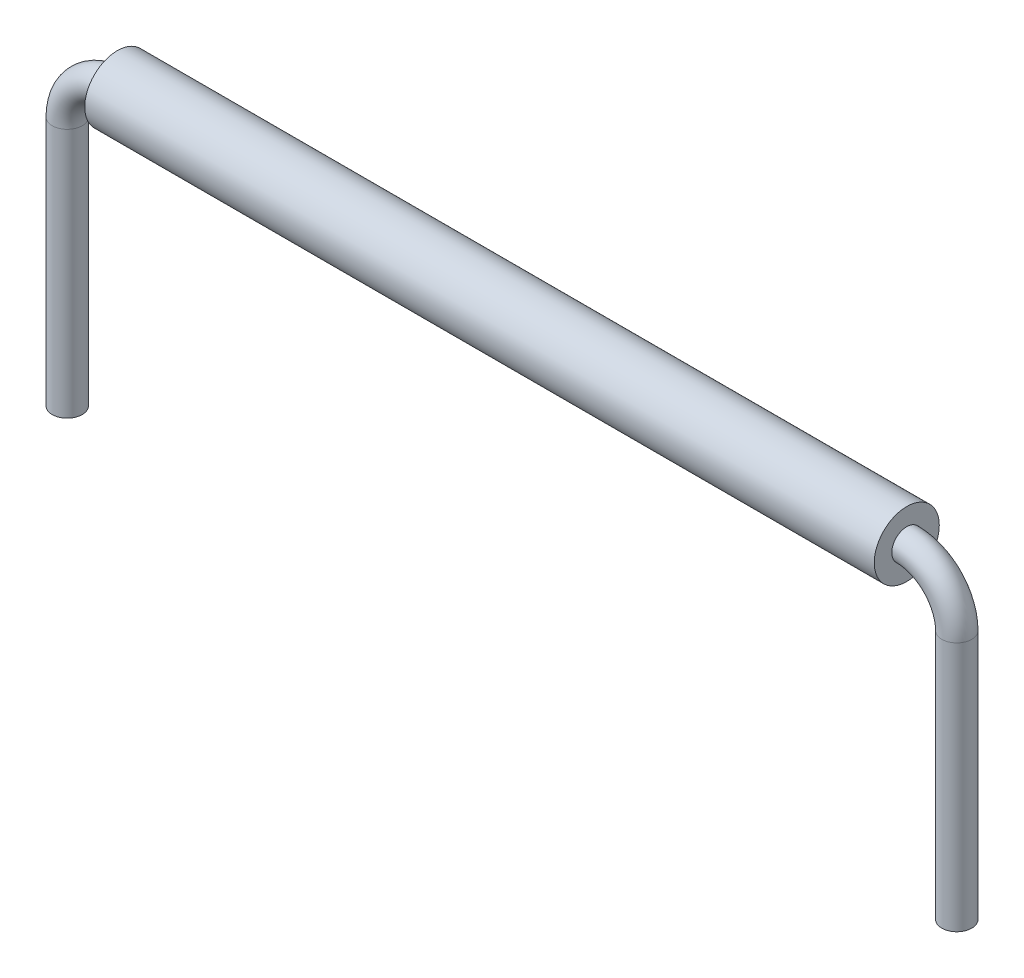
ISO-10303-21;
HEADER;
FILE_DESCRIPTION(('STEP AP214'),'2;1');
FILE_NAME('part.step','',(''),(''),'','','');
FILE_SCHEMA(('AUTOMOTIVE_DESIGN { 1 0 10303 214 1 1 1 1 }'));
ENDSEC;
DATA;
#1=APPLICATION_CONTEXT('core data for automotive mechanical design processes');
#2=APPLICATION_PROTOCOL_DEFINITION('international standard','automotive_design',2000,#1);
#3=PRODUCT_CONTEXT('',#1,'mechanical');
#4=PRODUCT('Part','Part','',(#3));
#5=PRODUCT_RELATED_PRODUCT_CATEGORY('part','',(#4));
#6=PRODUCT_DEFINITION_FORMATION('','',#4);
#7=PRODUCT_DEFINITION_CONTEXT('part definition',#1,'design');
#8=PRODUCT_DEFINITION('design','',#6,#7);
#9=PRODUCT_DEFINITION_SHAPE('','',#8);
#10=(LENGTH_UNIT() NAMED_UNIT(*) SI_UNIT(.MILLI.,.METRE.));
#11=(NAMED_UNIT(*) PLANE_ANGLE_UNIT() SI_UNIT($,.RADIAN.));
#12=(NAMED_UNIT(*) SI_UNIT($,.STERADIAN.) SOLID_ANGLE_UNIT());
#13=UNCERTAINTY_MEASURE_WITH_UNIT(LENGTH_MEASURE(1.E-05),#10,'distance_accuracy_value','');
#14=(GEOMETRIC_REPRESENTATION_CONTEXT(3) GLOBAL_UNCERTAINTY_ASSIGNED_CONTEXT((#13)) GLOBAL_UNIT_ASSIGNED_CONTEXT((#10,
#11,#12)) REPRESENTATION_CONTEXT('',''));
#15=CARTESIAN_POINT('',(0.,0.,0.));
#16=DIRECTION('',(0.,0.,1.));
#17=DIRECTION('',(1.,0.,0.));
#18=AXIS2_PLACEMENT_3D('',#15,#16,#17);
#19=CARTESIAN_POINT('',(7.89,0.,0.));
#20=DIRECTION('',(1.,0.,0.));
#21=DIRECTION('',(0.,0.,-1.));
#22=AXIS2_PLACEMENT_3D('',#19,#20,#21);
#23=PLANE('',#22);
#24=CARTESIAN_POINT('',(7.89,0.,0.));
#25=DIRECTION('',(1.,0.,0.));
#26=DIRECTION('',(0.,0.,-1.));
#27=AXIS2_PLACEMENT_3D('',#24,#25,#26);
#28=CIRCLE('',#27,0.65);
#29=CARTESIAN_POINT('',(7.89,0.,-0.65));
#30=VERTEX_POINT('',#29);
#31=EDGE_CURVE('E11',#30,#30,#28,.T.);
#32=ORIENTED_EDGE('',*,*,#31,.T.);
#33=EDGE_LOOP('',(#32));
#34=FACE_BOUND('',#33,.T.);
#35=CARTESIAN_POINT('',(7.89,0.,0.));
#36=DIRECTION('',(1.,0.,0.));
#37=DIRECTION('',(0.,0.,-1.));
#38=AXIS2_PLACEMENT_3D('',#35,#36,#37);
#39=CIRCLE('',#38,0.3);
#40=CARTESIAN_POINT('',(7.89,0.,-0.3));
#41=VERTEX_POINT('',#40);
#42=EDGE_CURVE('E52',#41,#41,#39,.T.);
#43=ORIENTED_EDGE('',*,*,#42,.F.);
#44=EDGE_LOOP('',(#43));
#45=FACE_BOUND('',#44,.T.);
#46=ADVANCED_FACE('F45',(#34,#45),#23,.T.);
#47=CARTESIAN_POINT('',(7.89,0.,0.));
#48=DIRECTION('',(-1.,0.,0.));
#49=DIRECTION('',(0.,0.,1.));
#50=AXIS2_PLACEMENT_3D('',#47,#48,#49);
#51=CYLINDRICAL_SURFACE('',#50,0.65);
#52=ORIENTED_EDGE('',*,*,#31,.F.);
#53=EDGE_LOOP('',(#52));
#54=FACE_BOUND('',#53,.T.);
#55=CARTESIAN_POINT('',(-7.89,0.,0.));
#56=DIRECTION('',(1.,0.,0.));
#57=DIRECTION('',(0.,0.,-1.));
#58=AXIS2_PLACEMENT_3D('',#55,#56,#57);
#59=CIRCLE('',#58,0.65);
#60=CARTESIAN_POINT('',(-7.89,0.,-0.65));
#61=VERTEX_POINT('',#60);
#62=EDGE_CURVE('E56',#61,#61,#59,.T.);
#63=ORIENTED_EDGE('',*,*,#62,.T.);
#64=EDGE_LOOP('',(#63));
#65=FACE_BOUND('',#64,.T.);
#66=ADVANCED_FACE('F47',(#54,#65),#51,.T.);
#67=CARTESIAN_POINT('',(7.89,0.,0.));
#68=DIRECTION('',(-1.,0.,0.));
#69=DIRECTION('',(0.,0.,1.));
#70=AXIS2_PLACEMENT_3D('',#67,#68,#69);
#71=CYLINDRICAL_SURFACE('',#70,0.3);
#72=ORIENTED_EDGE('',*,*,#42,.T.);
#73=EDGE_LOOP('',(#72));
#74=FACE_BOUND('',#73,.T.);
#75=CARTESIAN_POINT('',(-7.89,0.,0.));
#76=DIRECTION('',(1.,0.,0.));
#77=DIRECTION('',(0.,0.,-1.));
#78=AXIS2_PLACEMENT_3D('',#75,#76,#77);
#79=CIRCLE('',#78,0.3);
#80=CARTESIAN_POINT('',(-7.89,0.,-0.3));
#81=VERTEX_POINT('',#80);
#82=EDGE_CURVE('E60',#81,#81,#79,.T.);
#83=ORIENTED_EDGE('',*,*,#82,.F.);
#84=EDGE_LOOP('',(#83));
#85=FACE_BOUND('',#84,.T.);
#86=ADVANCED_FACE('F69',(#74,#85),#71,.F.);
#87=CARTESIAN_POINT('',(-7.89,0.,0.));
#88=DIRECTION('',(1.,0.,0.));
#89=DIRECTION('',(0.,0.,-1.));
#90=AXIS2_PLACEMENT_3D('',#87,#88,#89);
#91=PLANE('',#90);
#92=ORIENTED_EDGE('',*,*,#82,.T.);
#93=EDGE_LOOP('',(#92));
#94=FACE_BOUND('',#93,.T.);
#95=ORIENTED_EDGE('',*,*,#62,.F.);
#96=EDGE_LOOP('',(#95));
#97=FACE_BOUND('',#96,.T.);
#98=ADVANCED_FACE('F66',(#94,#97),#91,.F.);
#99=CLOSED_SHELL('',(#46,#66,#86,#98));
#100=MANIFOLD_SOLID_BREP('B2',#99);
#101=CARTESIAN_POINT('',(8.89,-6.,0.));
#102=DIRECTION('',(0.,-1.,0.));
#103=DIRECTION('',(0.,0.,-1.));
#104=AXIS2_PLACEMENT_3D('',#101,#102,#103);
#105=PLANE('',#104);
#106=CARTESIAN_POINT('',(8.89,-6.,0.));
#107=DIRECTION('',(0.,-1.,0.));
#108=DIRECTION('',(0.,0.,-1.));
#109=AXIS2_PLACEMENT_3D('',#106,#107,#108);
#110=CIRCLE('',#109,0.3);
#111=CARTESIAN_POINT('',(8.89,-6.,-0.3));
#112=VERTEX_POINT('',#111);
#113=EDGE_CURVE('E129',#112,#112,#110,.T.);
#114=ORIENTED_EDGE('',*,*,#113,.T.);
#115=EDGE_LOOP('',(#114));
#116=FACE_BOUND('',#115,.T.);
#117=ADVANCED_FACE('F107',(#116),#105,.T.);
#118=CARTESIAN_POINT('',(-8.89,-6.,0.));
#119=DIRECTION('',(0.,1.,0.));
#120=DIRECTION('',(0.,0.,-1.));
#121=AXIS2_PLACEMENT_3D('',#118,#119,#120);
#122=PLANE('',#121);
#123=CARTESIAN_POINT('',(-8.89,-6.,0.));
#124=DIRECTION('',(0.,1.,0.));
#125=DIRECTION('',(0.,0.,-1.));
#126=AXIS2_PLACEMENT_3D('',#123,#124,#125);
#127=CIRCLE('',#126,0.3);
#128=CARTESIAN_POINT('',(-8.89,-6.,-0.3));
#129=VERTEX_POINT('',#128);
#130=EDGE_CURVE('E44',#129,#129,#127,.T.);
#131=ORIENTED_EDGE('',*,*,#130,.F.);
#132=EDGE_LOOP('',(#131));
#133=FACE_BOUND('',#132,.T.);
#134=ADVANCED_FACE('F137',(#133),#122,.F.);
#135=CARTESIAN_POINT('',(8.89,-6.,0.));
#136=DIRECTION('',(0.,1.,0.));
#137=DIRECTION('',(0.,0.,1.));
#138=AXIS2_PLACEMENT_3D('',#135,#136,#137);
#139=CYLINDRICAL_SURFACE('',#138,0.3);
#140=CARTESIAN_POINT('',(8.89,-0.999999999999998,0.));
#141=DIRECTION('',(0.,-1.,0.));
#142=DIRECTION('',(0.,0.,-1.));
#143=AXIS2_PLACEMENT_3D('',#140,#141,#142);
#144=CIRCLE('',#143,0.3);
#145=CARTESIAN_POINT('',(9.19,-0.999999999999998,0.));
#146=VERTEX_POINT('',#145);
#147=EDGE_CURVE('E126',#146,#146,#144,.T.);
#148=ORIENTED_EDGE('',*,*,#147,.T.);
#149=EDGE_LOOP('',(#148));
#150=FACE_BOUND('',#149,.T.);
#151=ORIENTED_EDGE('',*,*,#113,.F.);
#152=EDGE_LOOP('',(#151));
#153=FACE_BOUND('',#152,.T.);
#154=ADVANCED_FACE('F134',(#150,#153),#139,.T.);
#155=CARTESIAN_POINT('',(7.89,-0.999999999999998,0.));
#156=DIRECTION('',(0.,0.,1.));
#157=DIRECTION('',(1.,0.,0.));
#158=AXIS2_PLACEMENT_3D('',#155,#156,#157);
#159=TOROIDAL_SURFACE('',#158,0.999999999999999,0.3);
#160=CARTESIAN_POINT('',(7.89,0.,0.));
#161=DIRECTION('',(1.,0.,0.));
#162=DIRECTION('',(0.,0.,-1.));
#163=AXIS2_PLACEMENT_3D('',#160,#161,#162);
#164=CIRCLE('',#163,0.3);
#165=CARTESIAN_POINT('',(7.89,0.300000000000001,0.));
#166=VERTEX_POINT('',#165);
#167=EDGE_CURVE('E121',#166,#166,#164,.T.);
#168=CARTESIAN_POINT('',(7.89,-0.999999999999998,0.));
#169=DIRECTION('',(0.,0.,1.));
#170=DIRECTION('',(1.,0.,0.));
#171=AXIS2_PLACEMENT_3D('',#168,#169,#170);
#172=CIRCLE('',#171,1.3);
#173=EDGE_CURVE('',#146,#166,#172,.T.);
#174=ORIENTED_EDGE('',*,*,#147,.F.);
#175=ORIENTED_EDGE('',*,*,#167,.T.);
#176=ORIENTED_EDGE('',*,*,#173,.T.);
#177=ORIENTED_EDGE('',*,*,#173,.F.);
#178=EDGE_LOOP('',(#174,#176,#175,#177));
#179=FACE_BOUND('',#178,.T.);
#180=ADVANCED_FACE('F136',(#179),#159,.T.);
#181=CARTESIAN_POINT('',(7.89,0.,0.));
#182=DIRECTION('',(-1.,0.,0.));
#183=DIRECTION('',(0.,-1.,0.));
#184=AXIS2_PLACEMENT_3D('',#181,#182,#183);
#185=CYLINDRICAL_SURFACE('',#184,0.3);
#186=CARTESIAN_POINT('',(-7.89,0.,0.));
#187=DIRECTION('',(1.,0.,0.));
#188=DIRECTION('',(0.,0.,-1.));
#189=AXIS2_PLACEMENT_3D('',#186,#187,#188);
#190=CIRCLE('',#189,0.3);
#191=CARTESIAN_POINT('',(-7.89,0.299999999999999,0.));
#192=VERTEX_POINT('',#191);
#193=EDGE_CURVE('E117',#192,#192,#190,.T.);
#194=ORIENTED_EDGE('',*,*,#193,.T.);
#195=EDGE_LOOP('',(#194));
#196=FACE_BOUND('',#195,.T.);
#197=ORIENTED_EDGE('',*,*,#167,.F.);
#198=EDGE_LOOP('',(#197));
#199=FACE_BOUND('',#198,.T.);
#200=ADVANCED_FACE('F144',(#196,#199),#185,.T.);
#201=CARTESIAN_POINT('',(-7.89,-1.,0.));
#202=DIRECTION('',(0.,0.,1.));
#203=DIRECTION('',(1.,0.,0.));
#204=AXIS2_PLACEMENT_3D('',#201,#202,#203);
#205=TOROIDAL_SURFACE('',#204,1.,0.3);
#206=CARTESIAN_POINT('',(-8.89,-1.,0.));
#207=DIRECTION('',(0.,1.,0.));
#208=DIRECTION('',(0.,0.,-1.));
#209=AXIS2_PLACEMENT_3D('',#206,#207,#208);
#210=CIRCLE('',#209,0.3);
#211=CARTESIAN_POINT('',(-9.19,-1.,0.));
#212=VERTEX_POINT('',#211);
#213=EDGE_CURVE('E113',#212,#212,#210,.T.);
#214=CARTESIAN_POINT('',(-7.89,-1.,0.));
#215=DIRECTION('',(0.,0.,1.));
#216=DIRECTION('',(1.,0.,0.));
#217=AXIS2_PLACEMENT_3D('',#214,#215,#216);
#218=CIRCLE('',#217,1.3);
#219=EDGE_CURVE('',#192,#212,#218,.T.);
#220=ORIENTED_EDGE('',*,*,#193,.F.);
#221=ORIENTED_EDGE('',*,*,#213,.T.);
#222=ORIENTED_EDGE('',*,*,#219,.T.);
#223=ORIENTED_EDGE('',*,*,#219,.F.);
#224=EDGE_LOOP('',(#220,#222,#221,#223));
#225=FACE_BOUND('',#224,.T.);
#226=ADVANCED_FACE('F150',(#225),#205,.T.);
#227=CARTESIAN_POINT('',(-8.89,-1.,0.));
#228=DIRECTION('',(0.,-1.,0.));
#229=DIRECTION('',(0.,0.,-1.));
#230=AXIS2_PLACEMENT_3D('',#227,#228,#229);
#231=CYLINDRICAL_SURFACE('',#230,0.3);
#232=ORIENTED_EDGE('',*,*,#130,.T.);
#233=EDGE_LOOP('',(#232));
#234=FACE_BOUND('',#233,.T.);
#235=ORIENTED_EDGE('',*,*,#213,.F.);
#236=EDGE_LOOP('',(#235));
#237=FACE_BOUND('',#236,.T.);
#238=ADVANCED_FACE('F148',(#234,#237),#231,.T.);
#239=CLOSED_SHELL('',(#117,#134,#154,#180,#200,#226,#238));
#240=MANIFOLD_SOLID_BREP('B6',#239);
#241=ADVANCED_BREP_SHAPE_REPRESENTATION('',(#18,#100,#240),#14);
#242=SHAPE_DEFINITION_REPRESENTATION(#9,#241);
ENDSEC;
END-ISO-10303-21;
